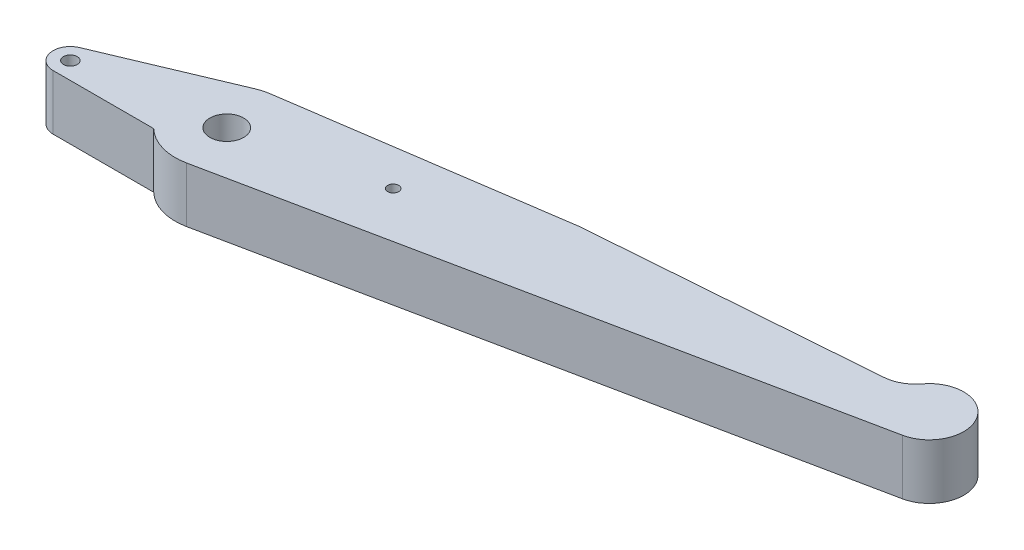
ISO-10303-21;
HEADER;
FILE_DESCRIPTION(('STEP AP214'),'2;1');
FILE_NAME('part.step','',(''),(''),'','','');
FILE_SCHEMA(('AUTOMOTIVE_DESIGN { 1 0 10303 214 1 1 1 1 }'));
ENDSEC;
DATA;
#1=APPLICATION_CONTEXT('core data for automotive mechanical design processes');
#2=APPLICATION_PROTOCOL_DEFINITION('international standard','automotive_design',2000,#1);
#3=PRODUCT_CONTEXT('',#1,'mechanical');
#4=PRODUCT('Part','Part','',(#3));
#5=PRODUCT_RELATED_PRODUCT_CATEGORY('part','',(#4));
#6=PRODUCT_DEFINITION_FORMATION('','',#4);
#7=PRODUCT_DEFINITION_CONTEXT('part definition',#1,'design');
#8=PRODUCT_DEFINITION('design','',#6,#7);
#9=PRODUCT_DEFINITION_SHAPE('','',#8);
#10=(LENGTH_UNIT() NAMED_UNIT(*) SI_UNIT(.MILLI.,.METRE.));
#11=(NAMED_UNIT(*) PLANE_ANGLE_UNIT() SI_UNIT($,.RADIAN.));
#12=(NAMED_UNIT(*) SI_UNIT($,.STERADIAN.) SOLID_ANGLE_UNIT());
#13=UNCERTAINTY_MEASURE_WITH_UNIT(LENGTH_MEASURE(1.E-05),#10,'distance_accuracy_value','');
#14=(GEOMETRIC_REPRESENTATION_CONTEXT(3) GLOBAL_UNCERTAINTY_ASSIGNED_CONTEXT((#13)) GLOBAL_UNIT_ASSIGNED_CONTEXT((#10,
#11,#12)) REPRESENTATION_CONTEXT('',''));
#15=CARTESIAN_POINT('',(0.,0.,0.));
#16=DIRECTION('',(0.,0.,1.));
#17=DIRECTION('',(1.,0.,0.));
#18=AXIS2_PLACEMENT_3D('',#15,#16,#17);
#19=CARTESIAN_POINT('',(-63.9301591270672,-2.9428043356824,-7.04527770769895));
#20=DIRECTION('',(0.,1.,0.));
#21=DIRECTION('',(-1.,0.,0.));
#22=AXIS2_PLACEMENT_3D('',#19,#20,#21);
#23=CYLINDRICAL_SURFACE('',#22,7.5);
#24=DIRECTION('',(0.,-1.,0.));
#25=VECTOR('',#24,1.);
#26=CARTESIAN_POINT('',(-66.8425068875703,5.0611956643176,-13.9567341766274));
#27=LINE('',#26,#25);
#28=CARTESIAN_POINT('',(-66.8425068875703,5.0591956643176,-13.9567341766274));
#29=VERTEX_POINT('',#28);
#30=CARTESIAN_POINT('',(-66.8425068875703,-2.9408043356824,-13.9567341766274));
#31=VERTEX_POINT('',#30);
#32=EDGE_CURVE('E11',#29,#31,#27,.T.);
#33=ORIENTED_EDGE('',*,*,#32,.F.);
#34=CARTESIAN_POINT('',(-63.9301591270672,5.0591956643176,-7.04527770769895));
#35=DIRECTION('',(0.,-1.,0.));
#36=DIRECTION('',(1.,0.,0.));
#37=AXIS2_PLACEMENT_3D('',#34,#35,#36);
#38=CIRCLE('',#37,7.5);
#39=CARTESIAN_POINT('',(-65.0221636035334,5.0591956643176,-14.465353598374));
#40=VERTEX_POINT('',#39);
#41=EDGE_CURVE('E26',#29,#40,#38,.T.);
#42=ORIENTED_EDGE('',*,*,#41,.T.);
#43=DIRECTION('',(0.,1.,0.));
#44=VECTOR('',#43,1.);
#45=CARTESIAN_POINT('',(-65.0221636035334,-2.94280433568239,-14.465353598374));
#46=LINE('',#45,#44);
#47=CARTESIAN_POINT('',(-65.0221636035334,-2.9408043356824,-14.465353598374));
#48=VERTEX_POINT('',#47);
#49=EDGE_CURVE('E191',#48,#40,#46,.T.);
#50=ORIENTED_EDGE('',*,*,#49,.F.);
#51=CARTESIAN_POINT('',(-63.9301591270672,-2.9408043356824,-7.04527770769895));
#52=DIRECTION('',(0.,1.,0.));
#53=DIRECTION('',(-1.,0.,0.));
#54=AXIS2_PLACEMENT_3D('',#51,#52,#53);
#55=CIRCLE('',#54,7.5);
#56=EDGE_CURVE('E187',#48,#31,#55,.T.);
#57=ORIENTED_EDGE('',*,*,#56,.T.);
#58=EDGE_LOOP('',(#33,#42,#50,#57));
#59=FACE_BOUND('',#58,.T.);
#60=ADVANCED_FACE('F17',(#59),#23,.T.);
#61=CARTESIAN_POINT('',(-70.1493873380862,-2.9408043356824,12.6137558796229));
#62=DIRECTION('',(0.,1.,0.));
#63=DIRECTION('',(-1.,0.,0.));
#64=AXIS2_PLACEMENT_3D('',#61,#62,#63);
#65=PLANE('',#64);
#66=CARTESIAN_POINT('',(-44.2197813222584,-2.9408043356824,-11.4804763268189));
#67=DIRECTION('',(0.,-1.,0.));
#68=DIRECTION('',(1.,0.,0.));
#69=AXIS2_PLACEMENT_3D('',#66,#67,#68);
#70=CIRCLE('',#69,0.799999999999794);
#71=CARTESIAN_POINT('',(-43.4197813222586,-2.9408043356824,-11.4804763268189));
#72=VERTEX_POINT('',#71);
#73=EDGE_CURVE('E183',#72,#72,#70,.T.);
#74=ORIENTED_EDGE('',*,*,#73,.F.);
#75=EDGE_LOOP('',(#74));
#76=FACE_BOUND('',#75,.T.);
#77=CARTESIAN_POINT('',(-63.9301591270672,-2.9408043356824,-7.04527770769894));
#78=DIRECTION('',(0.,1.,0.));
#79=DIRECTION('',(-1.,0.,0.));
#80=AXIS2_PLACEMENT_3D('',#77,#78,#79);
#81=CIRCLE('',#80,2.45);
#82=CARTESIAN_POINT('',(-66.3801591270672,-2.94080433568239,-7.04527770769894));
#83=VERTEX_POINT('',#82);
#84=EDGE_CURVE('E179',#83,#83,#81,.F.);
#85=ORIENTED_EDGE('',*,*,#84,.F.);
#86=EDGE_LOOP('',(#85));
#87=FACE_BOUND('',#86,.T.);
#88=DIRECTION('',(-0.997090045377094,0.,0.0762328105864147));
#89=VECTOR('',#88,1.);
#90=CARTESIAN_POINT('',(-72.38773521492,-2.9408043356824,-16.6628032412295));
#91=LINE('',#90,#89);
#92=CARTESIAN_POINT('',(15.1235824129638,-2.9408043356824,-23.35350658525));
#93=VERTEX_POINT('',#92);
#94=CARTESIAN_POINT('',(-25.9831966606522,-2.9408043356824,-20.2106757873039));
#95=VERTEX_POINT('',#94);
#96=EDGE_CURVE('E175',#93,#95,#91,.T.);
#97=ORIENTED_EDGE('',*,*,#96,.F.);
#98=CARTESIAN_POINT('',(14.7424183600317,-2.9408043356824,-28.3389568121355));
#99=DIRECTION('',(0.,1.,0.));
#100=DIRECTION('',(-1.,0.,0.));
#101=AXIS2_PLACEMENT_3D('',#98,#99,#100);
#102=CIRCLE('',#101,5.);
#103=CARTESIAN_POINT('',(18.7376707490194,-2.9408043356824,-25.3326370772623));
#104=VERTEX_POINT('',#103);
#105=EDGE_CURVE('E173',#93,#104,#102,.T.);
#106=ORIENTED_EDGE('',*,*,#105,.T.);
#107=CARTESIAN_POINT('',(22.732923138007,-2.9408043356824,-22.326317342389));
#108=DIRECTION('',(0.,1.,0.));
#109=DIRECTION('',(-1.,0.,0.));
#110=AXIS2_PLACEMENT_3D('',#107,#108,#109);
#111=CIRCLE('',#110,5.);
#112=CARTESIAN_POINT('',(23.7407010521509,-2.9408043356824,-17.4289319505942));
#113=VERTEX_POINT('',#112);
#114=EDGE_CURVE('E170',#113,#104,#111,.T.);
#115=ORIENTED_EDGE('',*,*,#114,.F.);
#116=DIRECTION('',(-0.979477078358938,0.,0.201555582828753));
#117=VECTOR('',#116,1.);
#118=CARTESIAN_POINT('',(-19.3388956018503,-2.9408043356824,-8.56406578530053));
#119=LINE('',#118,#117);
#120=CARTESIAN_POINT('',(-62.4184922558516,-2.9408043356824,0.300800379993094));
#121=VERTEX_POINT('',#120);
#122=EDGE_CURVE('E109',#113,#121,#119,.T.);
#123=ORIENTED_EDGE('',*,*,#122,.T.);
#124=CARTESIAN_POINT('',(-69.1224733308822,-2.9408043356824,-1.63326577045596));
#125=VERTEX_POINT('',#124);
#126=EDGE_CURVE('E167',#125,#121,#55,.T.);
#127=ORIENTED_EDGE('',*,*,#126,.F.);
#128=DIRECTION('',(1.,0.,0.));
#129=VECTOR('',#128,1.);
#130=CARTESIAN_POINT('',(-76.4197507498749,-2.9408043356824,-1.63326577045595));
#131=LINE('',#130,#129);
#132=CARTESIAN_POINT('',(-83.7170281688675,-2.9408043356824,-1.63326577045595));
#133=VERTEX_POINT('',#132);
#134=EDGE_CURVE('E163',#133,#125,#131,.T.);
#135=ORIENTED_EDGE('',*,*,#134,.F.);
#136=CARTESIAN_POINT('',(-83.7170281688675,-2.9408043356824,-4.13326577045595));
#137=DIRECTION('',(0.,-1.,0.));
#138=DIRECTION('',(1.,0.,0.));
#139=AXIS2_PLACEMENT_3D('',#136,#137,#138);
#140=CIRCLE('',#139,2.5);
#141=CARTESIAN_POINT('',(-84.6878107557019,-2.9408043356824,-6.4370845934321));
#142=VERTEX_POINT('',#141);
#143=EDGE_CURVE('E160',#133,#142,#140,.T.);
#144=ORIENTED_EDGE('',*,*,#143,.T.);
#145=DIRECTION('',(0.921527529190457,0.,-0.388313034733746));
#146=VECTOR('',#145,1.);
#147=CARTESIAN_POINT('',(-75.7651588216361,-2.9408043356824,-10.1969093850297));
#148=LINE('',#147,#146);
#149=EDGE_CURVE('E156',#142,#31,#148,.T.);
#150=ORIENTED_EDGE('',*,*,#149,.T.);
#151=ORIENTED_EDGE('',*,*,#56,.F.);
#152=DIRECTION('',(0.989343452090014,0.,-0.14560059686215));
#153=VECTOR('',#152,1.);
#154=CARTESIAN_POINT('',(-21.5086217249185,-2.9408043356824,-20.8691941006065));
#155=LINE('',#154,#153);
#156=EDGE_CURVE('E153',#48,#95,#155,.T.);
#157=ORIENTED_EDGE('',*,*,#156,.T.);
#158=EDGE_LOOP('',(#97,#106,#115,#123,#127,#135,#144,#150,#151,#157));
#159=FACE_BOUND('',#158,.T.);
#160=CARTESIAN_POINT('',(-83.7170281688675,-2.9408043356824,-4.13326577045595));
#161=DIRECTION('',(0.,-1.,0.));
#162=DIRECTION('',(1.,0.,0.));
#163=AXIS2_PLACEMENT_3D('',#160,#161,#162);
#164=CIRCLE('',#163,1.);
#165=CARTESIAN_POINT('',(-82.7170281688675,-2.9408043356824,-4.13326577045595));
#166=VERTEX_POINT('',#165);
#167=EDGE_CURVE('E149',#166,#166,#164,.T.);
#168=ORIENTED_EDGE('',*,*,#167,.F.);
#169=EDGE_LOOP('',(#168));
#170=FACE_BOUND('',#169,.T.);
#171=ADVANCED_FACE('F247',(#76,#87,#159,#170),#65,.F.);
#172=CARTESIAN_POINT('',(-21.5086217249185,-2.9428043356824,-20.8691941006065));
#173=DIRECTION('',(-0.14560059686215,0.,-0.989343452090014));
#174=DIRECTION('',(-0.989343452090014,0.,0.14560059686215));
#175=AXIS2_PLACEMENT_3D('',#172,#173,#174);
#176=PLANE('',#175);
#177=DIRECTION('',(-0.989343452090014,0.,0.14560059686215));
#178=VECTOR('',#177,1.);
#179=CARTESIAN_POINT('',(-21.5086217249185,5.0591956643176,-20.8691941006065));
#180=LINE('',#179,#178);
#181=CARTESIAN_POINT('',(-25.9831966606521,5.0591956643176,-20.2106757873039));
#182=VERTEX_POINT('',#181);
#183=EDGE_CURVE('E145',#182,#40,#180,.T.);
#184=ORIENTED_EDGE('',*,*,#183,.F.);
#185=DIRECTION('',(0.,1.,0.));
#186=VECTOR('',#185,1.);
#187=CARTESIAN_POINT('',(-25.9831966606521,-19.9408043356824,-20.2106757873039));
#188=LINE('',#187,#186);
#189=EDGE_CURVE('E141',#95,#182,#188,.T.);
#190=ORIENTED_EDGE('',*,*,#189,.F.);
#191=ORIENTED_EDGE('',*,*,#156,.F.);
#192=ORIENTED_EDGE('',*,*,#49,.T.);
#193=EDGE_LOOP('',(#184,#190,#191,#192));
#194=FACE_BOUND('',#193,.T.);
#195=ADVANCED_FACE('F255',(#194),#176,.T.);
#196=CARTESIAN_POINT('',(-62.4184922558516,5.0591956643176,0.300800379993095));
#197=VERTEX_POINT('',#196);
#198=CARTESIAN_POINT('',(-69.1224733308822,5.0591956643176,-1.63326577045595));
#199=VERTEX_POINT('',#198);
#200=EDGE_CURVE('E98',#197,#199,#38,.T.);
#201=ORIENTED_EDGE('',*,*,#200,.T.);
#202=DIRECTION('',(0.,-1.,0.));
#203=VECTOR('',#202,1.);
#204=CARTESIAN_POINT('',(-69.1224733308822,5.0611956643176,-1.63326577045596));
#205=LINE('',#204,#203);
#206=EDGE_CURVE('E137',#199,#125,#205,.T.);
#207=ORIENTED_EDGE('',*,*,#206,.T.);
#208=ORIENTED_EDGE('',*,*,#126,.T.);
#209=DIRECTION('',(0.,1.,0.));
#210=VECTOR('',#209,1.);
#211=CARTESIAN_POINT('',(-62.4184922558516,-2.9428043356824,0.300800379993094));
#212=LINE('',#211,#210);
#213=EDGE_CURVE('E128',#121,#197,#212,.T.);
#214=ORIENTED_EDGE('',*,*,#213,.T.);
#215=EDGE_LOOP('',(#201,#207,#208,#214));
#216=FACE_BOUND('',#215,.T.);
#217=ADVANCED_FACE('F19',(#216),#23,.T.);
#218=CARTESIAN_POINT('',(-21.84861799453,5.0591956643176,-11.8465081312149));
#219=DIRECTION('',(0.,-1.,0.));
#220=DIRECTION('',(1.,0.,0.));
#221=AXIS2_PLACEMENT_3D('',#218,#219,#220);
#222=PLANE('',#221);
#223=CARTESIAN_POINT('',(-44.2197813222584,5.0591956643176,-11.4804763268189));
#224=DIRECTION('',(0.,-1.,0.));
#225=DIRECTION('',(1.,0.,0.));
#226=AXIS2_PLACEMENT_3D('',#223,#224,#225);
#227=CIRCLE('',#226,0.799999999999794);
#228=CARTESIAN_POINT('',(-43.4197813222586,5.0591956643176,-11.4804763268189));
#229=VERTEX_POINT('',#228);
#230=EDGE_CURVE('E120',#229,#229,#227,.T.);
#231=ORIENTED_EDGE('',*,*,#230,.T.);
#232=EDGE_LOOP('',(#231));
#233=FACE_BOUND('',#232,.T.);
#234=CARTESIAN_POINT('',(22.732923138007,5.05919566431759,-22.326317342389));
#235=DIRECTION('',(0.,-1.,0.));
#236=DIRECTION('',(1.,0.,0.));
#237=AXIS2_PLACEMENT_3D('',#234,#235,#236);
#238=CIRCLE('',#237,5.);
#239=CARTESIAN_POINT('',(18.7376707490194,5.05919566431759,-25.3326370772623));
#240=VERTEX_POINT('',#239);
#241=CARTESIAN_POINT('',(23.7407010521509,5.05919566431759,-17.4289319505942));
#242=VERTEX_POINT('',#241);
#243=EDGE_CURVE('E95',#240,#242,#238,.T.);
#244=ORIENTED_EDGE('',*,*,#243,.F.);
#245=CARTESIAN_POINT('',(14.7424183600317,5.05919566431759,-28.3389568121355));
#246=DIRECTION('',(0.,-1.,0.));
#247=DIRECTION('',(1.,0.,0.));
#248=AXIS2_PLACEMENT_3D('',#245,#246,#247);
#249=CIRCLE('',#248,5.);
#250=CARTESIAN_POINT('',(15.1235824129637,5.05919566431759,-23.35350658525));
#251=VERTEX_POINT('',#250);
#252=EDGE_CURVE('E121',#240,#251,#249,.T.);
#253=ORIENTED_EDGE('',*,*,#252,.T.);
#254=DIRECTION('',(-0.997090045377094,0.,0.0762328105864147));
#255=VECTOR('',#254,1.);
#256=CARTESIAN_POINT('',(-4.04721566235606,5.05919566431759,-21.8877976202051));
#257=LINE('',#256,#255);
#258=EDGE_CURVE('E131',#251,#182,#257,.T.);
#259=ORIENTED_EDGE('',*,*,#258,.T.);
#260=ORIENTED_EDGE('',*,*,#183,.T.);
#261=ORIENTED_EDGE('',*,*,#41,.F.);
#262=DIRECTION('',(-0.921527529190457,0.,0.388313034733746));
#263=VECTOR('',#262,1.);
#264=CARTESIAN_POINT('',(-75.7651588216361,5.0591956643176,-10.1969093850297));
#265=LINE('',#264,#263);
#266=CARTESIAN_POINT('',(-84.6878107557019,5.0591956643176,-6.4370845934321));
#267=VERTEX_POINT('',#266);
#268=EDGE_CURVE('E207',#29,#267,#265,.T.);
#269=ORIENTED_EDGE('',*,*,#268,.T.);
#270=CARTESIAN_POINT('',(-83.7170281688675,5.0591956643176,-4.13326577045595));
#271=DIRECTION('',(0.,-1.,0.));
#272=DIRECTION('',(1.,0.,0.));
#273=AXIS2_PLACEMENT_3D('',#270,#271,#272);
#274=CIRCLE('',#273,2.5);
#275=CARTESIAN_POINT('',(-83.7170281688675,5.0591956643176,-1.63326577045595));
#276=VERTEX_POINT('',#275);
#277=EDGE_CURVE('E230',#267,#276,#274,.F.);
#278=ORIENTED_EDGE('',*,*,#277,.T.);
#279=DIRECTION('',(-1.,0.,0.));
#280=VECTOR('',#279,1.);
#281=CARTESIAN_POINT('',(-76.4197507498749,5.0591956643176,-1.63326577045595));
#282=LINE('',#281,#280);
#283=EDGE_CURVE('E102',#199,#276,#282,.T.);
#284=ORIENTED_EDGE('',*,*,#283,.F.);
#285=ORIENTED_EDGE('',*,*,#200,.F.);
#286=DIRECTION('',(0.979477078358938,0.,-0.201555582828753));
#287=VECTOR('',#286,1.);
#288=CARTESIAN_POINT('',(-19.3388956018503,5.05919566431759,-8.56406578530053));
#289=LINE('',#288,#287);
#290=EDGE_CURVE('E90',#197,#242,#289,.T.);
#291=ORIENTED_EDGE('',*,*,#290,.T.);
#292=EDGE_LOOP('',(#244,#253,#259,#260,#261,#269,#278,#284,#285,#291));
#293=FACE_BOUND('',#292,.T.);
#294=CARTESIAN_POINT('',(-63.9301591270672,5.0591956643176,-7.04527770769894));
#295=DIRECTION('',(0.,1.,0.));
#296=DIRECTION('',(-1.,0.,0.));
#297=AXIS2_PLACEMENT_3D('',#294,#295,#296);
#298=CIRCLE('',#297,2.45);
#299=CARTESIAN_POINT('',(-66.3801591270672,5.0591956643176,-7.04527770769894));
#300=VERTEX_POINT('',#299);
#301=EDGE_CURVE('E103',#300,#300,#298,.T.);
#302=ORIENTED_EDGE('',*,*,#301,.F.);
#303=EDGE_LOOP('',(#302));
#304=FACE_BOUND('',#303,.T.);
#305=CARTESIAN_POINT('',(-83.7170281688675,5.0591956643176,-4.13326577045595));
#306=DIRECTION('',(0.,-1.,0.));
#307=DIRECTION('',(1.,0.,0.));
#308=AXIS2_PLACEMENT_3D('',#305,#306,#307);
#309=CIRCLE('',#308,1.);
#310=CARTESIAN_POINT('',(-82.7170281688675,5.0591956643176,-4.13326577045595));
#311=VERTEX_POINT('',#310);
#312=EDGE_CURVE('E113',#311,#311,#309,.F.);
#313=ORIENTED_EDGE('',*,*,#312,.F.);
#314=EDGE_LOOP('',(#313));
#315=FACE_BOUND('',#314,.T.);
#316=ADVANCED_FACE('F92',(#233,#293,#304,#315),#222,.F.);
#317=CARTESIAN_POINT('',(-63.9301591270672,-2.9428043356824,-7.04527770769894));
#318=DIRECTION('',(0.,1.,0.));
#319=DIRECTION('',(-1.,0.,0.));
#320=AXIS2_PLACEMENT_3D('',#317,#318,#319);
#321=CYLINDRICAL_SURFACE('',#320,2.45);
#322=ORIENTED_EDGE('',*,*,#84,.T.);
#323=EDGE_LOOP('',(#322));
#324=FACE_BOUND('',#323,.T.);
#325=ORIENTED_EDGE('',*,*,#301,.T.);
#326=EDGE_LOOP('',(#325));
#327=FACE_BOUND('',#326,.T.);
#328=ADVANCED_FACE('F266',(#324,#327),#321,.F.);
#329=CARTESIAN_POINT('',(-19.3388956018503,-2.9428043356824,-8.56406578530053));
#330=DIRECTION('',(0.201555582828753,0.,0.979477078358938));
#331=DIRECTION('',(0.979477078358938,0.,-0.201555582828753));
#332=AXIS2_PLACEMENT_3D('',#329,#330,#331);
#333=PLANE('',#332);
#334=ORIENTED_EDGE('',*,*,#122,.F.);
#335=DIRECTION('',(0.,1.,0.));
#336=VECTOR('',#335,1.);
#337=CARTESIAN_POINT('',(23.7407010521509,-2.94280433568241,-17.4289319505942));
#338=LINE('',#337,#336);
#339=EDGE_CURVE('E107',#113,#242,#338,.T.);
#340=ORIENTED_EDGE('',*,*,#339,.T.);
#341=ORIENTED_EDGE('',*,*,#290,.F.);
#342=ORIENTED_EDGE('',*,*,#213,.F.);
#343=EDGE_LOOP('',(#334,#340,#341,#342));
#344=FACE_BOUND('',#343,.T.);
#345=ADVANCED_FACE('F108',(#344),#333,.T.);
#346=CARTESIAN_POINT('',(22.732923138007,-2.94280433568241,-22.326317342389));
#347=DIRECTION('',(0.,1.,0.));
#348=DIRECTION('',(-1.,0.,0.));
#349=AXIS2_PLACEMENT_3D('',#346,#347,#348);
#350=CYLINDRICAL_SURFACE('',#349,5.);
#351=ORIENTED_EDGE('',*,*,#114,.T.);
#352=DIRECTION('',(0.,1.,0.));
#353=VECTOR('',#352,1.);
#354=CARTESIAN_POINT('',(18.7376707490194,-2.94280433568241,-25.3326370772623));
#355=LINE('',#354,#353);
#356=EDGE_CURVE('E114',#104,#240,#355,.T.);
#357=ORIENTED_EDGE('',*,*,#356,.T.);
#358=ORIENTED_EDGE('',*,*,#243,.T.);
#359=ORIENTED_EDGE('',*,*,#339,.F.);
#360=EDGE_LOOP('',(#351,#357,#358,#359));
#361=FACE_BOUND('',#360,.T.);
#362=ADVANCED_FACE('F116',(#361),#350,.T.);
#363=CARTESIAN_POINT('',(-4.04721566235606,-19.9408043356824,-21.8877976202051));
#364=DIRECTION('',(-0.0762328105864147,0.,-0.997090045377094));
#365=DIRECTION('',(-0.997090045377094,0.,0.0762328105864147));
#366=AXIS2_PLACEMENT_3D('',#363,#364,#365);
#367=PLANE('',#366);
#368=ORIENTED_EDGE('',*,*,#258,.F.);
#369=DIRECTION('',(0.,1.,0.));
#370=VECTOR('',#369,1.);
#371=CARTESIAN_POINT('',(15.1235824129637,-19.9408043356824,-23.35350658525));
#372=LINE('',#371,#370);
#373=EDGE_CURVE('E211',#251,#93,#372,.F.);
#374=ORIENTED_EDGE('',*,*,#373,.T.);
#375=ORIENTED_EDGE('',*,*,#96,.T.);
#376=ORIENTED_EDGE('',*,*,#189,.T.);
#377=EDGE_LOOP('',(#368,#374,#375,#376));
#378=FACE_BOUND('',#377,.T.);
#379=ADVANCED_FACE('F251',(#378),#367,.T.);
#380=CARTESIAN_POINT('',(14.7424183600317,-2.94280433568241,-28.3389568121355));
#381=DIRECTION('',(0.,1.,0.));
#382=DIRECTION('',(-1.,0.,0.));
#383=AXIS2_PLACEMENT_3D('',#380,#381,#382);
#384=CYLINDRICAL_SURFACE('',#383,5.);
#385=ORIENTED_EDGE('',*,*,#105,.F.);
#386=ORIENTED_EDGE('',*,*,#373,.F.);
#387=ORIENTED_EDGE('',*,*,#252,.F.);
#388=ORIENTED_EDGE('',*,*,#356,.F.);
#389=EDGE_LOOP('',(#385,#386,#387,#388));
#390=FACE_BOUND('',#389,.T.);
#391=ADVANCED_FACE('F250',(#390),#384,.F.);
#392=CARTESIAN_POINT('',(-44.2197813222584,22.0591956643176,-11.4804763268189));
#393=DIRECTION('',(0.,-1.,0.));
#394=DIRECTION('',(1.,0.,0.));
#395=AXIS2_PLACEMENT_3D('',#392,#393,#394);
#396=CYLINDRICAL_SURFACE('',#395,0.799999999999794);
#397=ORIENTED_EDGE('',*,*,#73,.T.);
#398=EDGE_LOOP('',(#397));
#399=FACE_BOUND('',#398,.T.);
#400=ORIENTED_EDGE('',*,*,#230,.F.);
#401=EDGE_LOOP('',(#400));
#402=FACE_BOUND('',#401,.T.);
#403=ADVANCED_FACE('F283',(#399,#402),#396,.F.);
#404=CARTESIAN_POINT('',(-75.7651588216361,5.0611956643176,-10.1969093850297));
#405=DIRECTION('',(-0.388313034733746,0.,-0.921527529190457));
#406=DIRECTION('',(-0.921527529190457,0.,0.388313034733746));
#407=AXIS2_PLACEMENT_3D('',#404,#405,#406);
#408=PLANE('',#407);
#409=ORIENTED_EDGE('',*,*,#268,.F.);
#410=ORIENTED_EDGE('',*,*,#32,.T.);
#411=ORIENTED_EDGE('',*,*,#149,.F.);
#412=DIRECTION('',(0.,-1.,0.));
#413=VECTOR('',#412,1.);
#414=CARTESIAN_POINT('',(-84.6878107557019,5.0611956643176,-6.4370845934321));
#415=LINE('',#414,#413);
#416=EDGE_CURVE('E203',#267,#142,#415,.T.);
#417=ORIENTED_EDGE('',*,*,#416,.F.);
#418=EDGE_LOOP('',(#409,#410,#411,#417));
#419=FACE_BOUND('',#418,.T.);
#420=ADVANCED_FACE('F239',(#419),#408,.T.);
#421=CARTESIAN_POINT('',(-83.7170281688675,5.0611956643176,-4.13326577045595));
#422=DIRECTION('',(0.,-1.,0.));
#423=DIRECTION('',(1.,0.,0.));
#424=AXIS2_PLACEMENT_3D('',#421,#422,#423);
#425=CYLINDRICAL_SURFACE('',#424,2.5);
#426=ORIENTED_EDGE('',*,*,#277,.F.);
#427=ORIENTED_EDGE('',*,*,#416,.T.);
#428=ORIENTED_EDGE('',*,*,#143,.F.);
#429=DIRECTION('',(0.,-1.,0.));
#430=VECTOR('',#429,1.);
#431=CARTESIAN_POINT('',(-83.7170281688675,5.0611956643176,-1.63326577045595));
#432=LINE('',#431,#430);
#433=EDGE_CURVE('E201',#276,#133,#432,.T.);
#434=ORIENTED_EDGE('',*,*,#433,.F.);
#435=EDGE_LOOP('',(#426,#427,#428,#434));
#436=FACE_BOUND('',#435,.T.);
#437=ADVANCED_FACE('F242',(#436),#425,.T.);
#438=CARTESIAN_POINT('',(-76.4197507498749,5.0611956643176,-1.63326577045595));
#439=DIRECTION('',(0.,0.,-1.));
#440=DIRECTION('',(0.,1.,0.));
#441=AXIS2_PLACEMENT_3D('',#438,#439,#440);
#442=PLANE('',#441);
#443=ORIENTED_EDGE('',*,*,#206,.F.);
#444=ORIENTED_EDGE('',*,*,#283,.T.);
#445=ORIENTED_EDGE('',*,*,#433,.T.);
#446=ORIENTED_EDGE('',*,*,#134,.T.);
#447=EDGE_LOOP('',(#443,#444,#445,#446));
#448=FACE_BOUND('',#447,.T.);
#449=ADVANCED_FACE('F245',(#448),#442,.F.);
#450=CARTESIAN_POINT('',(-83.7170281688675,5.0611956643176,-4.13326577045595));
#451=DIRECTION('',(0.,-1.,0.));
#452=DIRECTION('',(1.,0.,0.));
#453=AXIS2_PLACEMENT_3D('',#450,#451,#452);
#454=CYLINDRICAL_SURFACE('',#453,1.);
#455=ORIENTED_EDGE('',*,*,#312,.T.);
#456=EDGE_LOOP('',(#455));
#457=FACE_BOUND('',#456,.T.);
#458=ORIENTED_EDGE('',*,*,#167,.T.);
#459=EDGE_LOOP('',(#458));
#460=FACE_BOUND('',#459,.T.);
#461=ADVANCED_FACE('F293',(#457,#460),#454,.F.);
#462=CLOSED_SHELL('',(#60,#171,#195,#217,#316,#328,#345,#362,#379,#391,#403,#420,#437,#449,#461));
#463=MANIFOLD_SOLID_BREP('B1',#462);
#464=ADVANCED_BREP_SHAPE_REPRESENTATION('',(#18,#463),#14);
#465=SHAPE_DEFINITION_REPRESENTATION(#9,#464);
ENDSEC;
END-ISO-10303-21;
